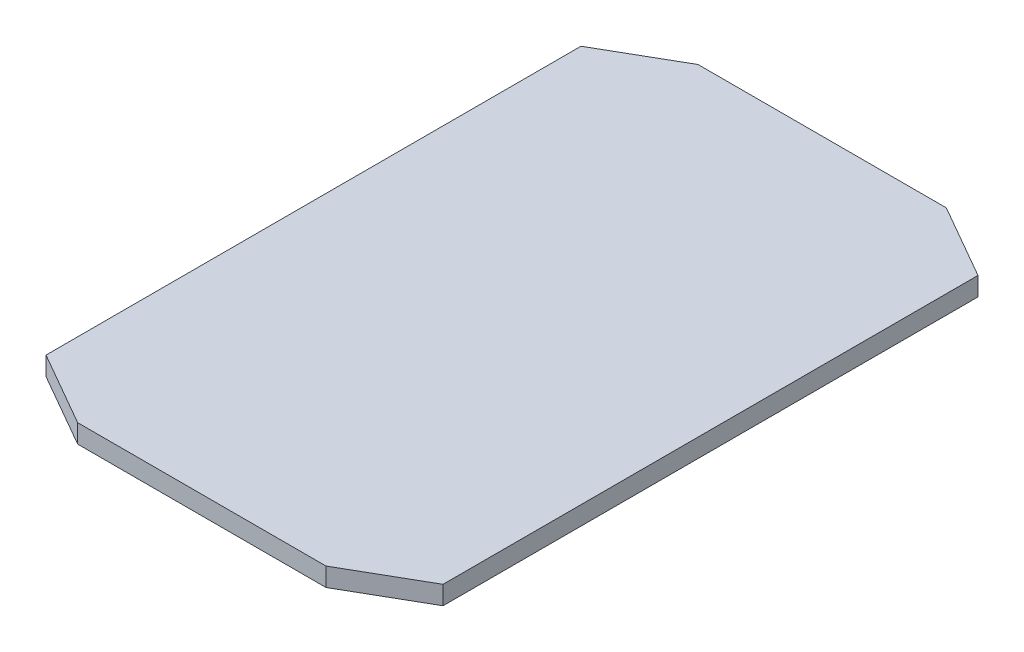
ISO-10303-21;
HEADER;
FILE_DESCRIPTION(('STEP AP214'),'2;1');
FILE_NAME('part.step','',(''),(''),'','','');
FILE_SCHEMA(('AUTOMOTIVE_DESIGN { 1 0 10303 214 1 1 1 1 }'));
ENDSEC;
DATA;
#1=APPLICATION_CONTEXT('core data for automotive mechanical design processes');
#2=APPLICATION_PROTOCOL_DEFINITION('international standard','automotive_design',2000,#1);
#3=PRODUCT_CONTEXT('',#1,'mechanical');
#4=PRODUCT('Part','Part','',(#3));
#5=PRODUCT_RELATED_PRODUCT_CATEGORY('part','',(#4));
#6=PRODUCT_DEFINITION_FORMATION('','',#4);
#7=PRODUCT_DEFINITION_CONTEXT('part definition',#1,'design');
#8=PRODUCT_DEFINITION('design','',#6,#7);
#9=PRODUCT_DEFINITION_SHAPE('','',#8);
#10=(LENGTH_UNIT() NAMED_UNIT(*) SI_UNIT(.MILLI.,.METRE.));
#11=(NAMED_UNIT(*) PLANE_ANGLE_UNIT() SI_UNIT($,.RADIAN.));
#12=(NAMED_UNIT(*) SI_UNIT($,.STERADIAN.) SOLID_ANGLE_UNIT());
#13=UNCERTAINTY_MEASURE_WITH_UNIT(LENGTH_MEASURE(1.E-05),#10,'distance_accuracy_value','');
#14=(GEOMETRIC_REPRESENTATION_CONTEXT(3) GLOBAL_UNCERTAINTY_ASSIGNED_CONTEXT((#13)) GLOBAL_UNIT_ASSIGNED_CONTEXT((#10,
#11,#12)) REPRESENTATION_CONTEXT('',''));
#15=CARTESIAN_POINT('',(0.,0.,0.));
#16=DIRECTION('',(0.,0.,1.));
#17=DIRECTION('',(1.,0.,0.));
#18=AXIS2_PLACEMENT_3D('',#15,#16,#17);
#19=CARTESIAN_POINT('',(-32.,3.,43.1177077057705));
#20=DIRECTION('',(1.,0.,0.));
#21=DIRECTION('',(0.,0.,-1.));
#22=AXIS2_PLACEMENT_3D('',#19,#20,#21);
#23=PLANE('',#22);
#24=DIRECTION('',(0.,0.,1.));
#25=VECTOR('',#24,1.);
#26=CARTESIAN_POINT('',(-32.,0.,43.1177077057705));
#27=LINE('',#26,#25);
#28=CARTESIAN_POINT('',(-32.,0.,-43.1177077057705));
#29=VERTEX_POINT('',#28);
#30=CARTESIAN_POINT('',(-32.,0.,43.1177077057705));
#31=VERTEX_POINT('',#30);
#32=EDGE_CURVE('E132',#29,#31,#27,.T.);
#33=ORIENTED_EDGE('',*,*,#32,.T.);
#34=DIRECTION('',(0.,-1.,0.));
#35=VECTOR('',#34,1.);
#36=CARTESIAN_POINT('',(-32.,3.,43.1177077057705));
#37=LINE('',#36,#35);
#38=CARTESIAN_POINT('',(-32.,3.,43.1177077057705));
#39=VERTEX_POINT('',#38);
#40=EDGE_CURVE('E11',#39,#31,#37,.T.);
#41=ORIENTED_EDGE('',*,*,#40,.F.);
#42=DIRECTION('',(0.,0.,1.));
#43=VECTOR('',#42,1.);
#44=CARTESIAN_POINT('',(-32.,3.,43.1177077057705));
#45=LINE('',#44,#43);
#46=CARTESIAN_POINT('',(-32.,3.,-43.1177077057705));
#47=VERTEX_POINT('',#46);
#48=EDGE_CURVE('E146',#47,#39,#45,.T.);
#49=ORIENTED_EDGE('',*,*,#48,.F.);
#50=DIRECTION('',(0.,-1.,0.));
#51=VECTOR('',#50,1.);
#52=CARTESIAN_POINT('',(-32.,3.,-43.1177077057705));
#53=LINE('',#52,#51);
#54=EDGE_CURVE('E128',#47,#29,#53,.T.);
#55=ORIENTED_EDGE('',*,*,#54,.T.);
#56=EDGE_LOOP('',(#33,#41,#49,#55));
#57=FACE_BOUND('',#56,.T.);
#58=ADVANCED_FACE('F36',(#57),#23,.F.);
#59=CARTESIAN_POINT('',(-32.,3.,43.1177077057705));
#60=DIRECTION('',(0.49788015877383,0.,-0.867245840289445));
#61=DIRECTION('',(-0.867245840289445,0.,-0.49788015877383));
#62=AXIS2_PLACEMENT_3D('',#59,#60,#61);
#63=PLANE('',#62);
#64=DIRECTION('',(0.867245840289445,0.,0.49788015877383));
#65=VECTOR('',#64,1.);
#66=CARTESIAN_POINT('',(-32.,0.,43.1177077057705));
#67=LINE('',#66,#65);
#68=CARTESIAN_POINT('',(-20.0118955161297,0.,50.));
#69=VERTEX_POINT('',#68);
#70=EDGE_CURVE('E135',#31,#69,#67,.T.);
#71=ORIENTED_EDGE('',*,*,#70,.T.);
#72=DIRECTION('',(0.,-1.,0.));
#73=VECTOR('',#72,1.);
#74=CARTESIAN_POINT('',(-20.0118955161297,3.,50.));
#75=LINE('',#74,#73);
#76=CARTESIAN_POINT('',(-20.0118955161297,3.,50.));
#77=VERTEX_POINT('',#76);
#78=EDGE_CURVE('E44',#77,#69,#75,.T.);
#79=ORIENTED_EDGE('',*,*,#78,.F.);
#80=DIRECTION('',(0.867245840289445,0.,0.49788015877383));
#81=VECTOR('',#80,1.);
#82=CARTESIAN_POINT('',(-32.,3.,43.1177077057705));
#83=LINE('',#82,#81);
#84=EDGE_CURVE('E95',#39,#77,#83,.T.);
#85=ORIENTED_EDGE('',*,*,#84,.F.);
#86=ORIENTED_EDGE('',*,*,#40,.T.);
#87=EDGE_LOOP('',(#71,#79,#85,#86));
#88=FACE_BOUND('',#87,.T.);
#89=ADVANCED_FACE('F181',(#88),#63,.F.);
#90=CARTESIAN_POINT('',(-20.0118955161297,3.,50.));
#91=DIRECTION('',(0.,0.,-1.));
#92=DIRECTION('',(-1.,0.,0.));
#93=AXIS2_PLACEMENT_3D('',#90,#91,#92);
#94=PLANE('',#93);
#95=DIRECTION('',(1.,0.,0.));
#96=VECTOR('',#95,1.);
#97=CARTESIAN_POINT('',(-20.0118955161297,0.,50.));
#98=LINE('',#97,#96);
#99=CARTESIAN_POINT('',(20.0118955161297,0.,50.));
#100=VERTEX_POINT('',#99);
#101=EDGE_CURVE('E137',#69,#100,#98,.T.);
#102=ORIENTED_EDGE('',*,*,#101,.T.);
#103=DIRECTION('',(0.,-1.,0.));
#104=VECTOR('',#103,1.);
#105=CARTESIAN_POINT('',(20.0118955161297,3.,50.));
#106=LINE('',#105,#104);
#107=CARTESIAN_POINT('',(20.0118955161297,3.,50.));
#108=VERTEX_POINT('',#107);
#109=EDGE_CURVE('E153',#108,#100,#106,.T.);
#110=ORIENTED_EDGE('',*,*,#109,.F.);
#111=DIRECTION('',(1.,0.,0.));
#112=VECTOR('',#111,1.);
#113=CARTESIAN_POINT('',(-20.0118955161297,3.,50.));
#114=LINE('',#113,#112);
#115=EDGE_CURVE('E161',#77,#108,#114,.T.);
#116=ORIENTED_EDGE('',*,*,#115,.F.);
#117=ORIENTED_EDGE('',*,*,#78,.T.);
#118=EDGE_LOOP('',(#102,#110,#116,#117));
#119=FACE_BOUND('',#118,.T.);
#120=ADVANCED_FACE('F159',(#119),#94,.F.);
#121=CARTESIAN_POINT('',(32.,3.,43.1177077057705));
#122=DIRECTION('',(-0.49788015877383,0.,-0.867245840289445));
#123=DIRECTION('',(-0.867245840289445,0.,0.49788015877383));
#124=AXIS2_PLACEMENT_3D('',#121,#122,#123);
#125=PLANE('',#124);
#126=DIRECTION('',(0.867245840289445,0.,-0.49788015877383));
#127=VECTOR('',#126,1.);
#128=CARTESIAN_POINT('',(32.,0.,43.1177077057705));
#129=LINE('',#128,#127);
#130=CARTESIAN_POINT('',(32.,0.,43.1177077057705));
#131=VERTEX_POINT('',#130);
#132=EDGE_CURVE('E139',#100,#131,#129,.T.);
#133=ORIENTED_EDGE('',*,*,#132,.T.);
#134=DIRECTION('',(0.,-1.,0.));
#135=VECTOR('',#134,1.);
#136=CARTESIAN_POINT('',(32.,3.,43.1177077057705));
#137=LINE('',#136,#135);
#138=CARTESIAN_POINT('',(32.,3.,43.1177077057705));
#139=VERTEX_POINT('',#138);
#140=EDGE_CURVE('E150',#139,#131,#137,.T.);
#141=ORIENTED_EDGE('',*,*,#140,.F.);
#142=DIRECTION('',(0.867245840289445,0.,-0.49788015877383));
#143=VECTOR('',#142,1.);
#144=CARTESIAN_POINT('',(32.,3.,43.1177077057705));
#145=LINE('',#144,#143);
#146=EDGE_CURVE('E173',#108,#139,#145,.T.);
#147=ORIENTED_EDGE('',*,*,#146,.F.);
#148=ORIENTED_EDGE('',*,*,#109,.T.);
#149=EDGE_LOOP('',(#133,#141,#147,#148));
#150=FACE_BOUND('',#149,.T.);
#151=ADVANCED_FACE('F169',(#150),#125,.F.);
#152=CARTESIAN_POINT('',(32.,3.,43.1177077057705));
#153=DIRECTION('',(-1.,0.,0.));
#154=DIRECTION('',(0.,0.,1.));
#155=AXIS2_PLACEMENT_3D('',#152,#153,#154);
#156=PLANE('',#155);
#157=DIRECTION('',(0.,0.,-1.));
#158=VECTOR('',#157,1.);
#159=CARTESIAN_POINT('',(32.,0.,43.1177077057705));
#160=LINE('',#159,#158);
#161=CARTESIAN_POINT('',(32.,0.,-43.1177077057705));
#162=VERTEX_POINT('',#161);
#163=EDGE_CURVE('E141',#131,#162,#160,.T.);
#164=ORIENTED_EDGE('',*,*,#163,.T.);
#165=DIRECTION('',(0.,-1.,0.));
#166=VECTOR('',#165,1.);
#167=CARTESIAN_POINT('',(32.,3.,-43.1177077057705));
#168=LINE('',#167,#166);
#169=CARTESIAN_POINT('',(32.,3.,-43.1177077057705));
#170=VERTEX_POINT('',#169);
#171=EDGE_CURVE('E123',#170,#162,#168,.T.);
#172=ORIENTED_EDGE('',*,*,#171,.F.);
#173=DIRECTION('',(0.,0.,-1.));
#174=VECTOR('',#173,1.);
#175=CARTESIAN_POINT('',(32.,3.,43.1177077057705));
#176=LINE('',#175,#174);
#177=EDGE_CURVE('E114',#139,#170,#176,.T.);
#178=ORIENTED_EDGE('',*,*,#177,.F.);
#179=ORIENTED_EDGE('',*,*,#140,.T.);
#180=EDGE_LOOP('',(#164,#172,#178,#179));
#181=FACE_BOUND('',#180,.T.);
#182=ADVANCED_FACE('F172',(#181),#156,.F.);
#183=CARTESIAN_POINT('',(32.,3.,-43.1177077057705));
#184=DIRECTION('',(-0.49788015877383,0.,0.867245840289445));
#185=DIRECTION('',(0.867245840289445,0.,0.49788015877383));
#186=AXIS2_PLACEMENT_3D('',#183,#184,#185);
#187=PLANE('',#186);
#188=DIRECTION('',(-0.867245840289445,0.,-0.49788015877383));
#189=VECTOR('',#188,1.);
#190=CARTESIAN_POINT('',(32.,0.,-43.1177077057705));
#191=LINE('',#190,#189);
#192=CARTESIAN_POINT('',(20.0118955161297,0.,-50.));
#193=VERTEX_POINT('',#192);
#194=EDGE_CURVE('E122',#162,#193,#191,.T.);
#195=ORIENTED_EDGE('',*,*,#194,.T.);
#196=DIRECTION('',(0.,-1.,0.));
#197=VECTOR('',#196,1.);
#198=CARTESIAN_POINT('',(20.0118955161297,3.,-50.));
#199=LINE('',#198,#197);
#200=CARTESIAN_POINT('',(20.0118955161297,3.,-50.));
#201=VERTEX_POINT('',#200);
#202=EDGE_CURVE('E119',#201,#193,#199,.T.);
#203=ORIENTED_EDGE('',*,*,#202,.F.);
#204=DIRECTION('',(-0.867245840289445,0.,-0.49788015877383));
#205=VECTOR('',#204,1.);
#206=CARTESIAN_POINT('',(32.,3.,-43.1177077057705));
#207=LINE('',#206,#205);
#208=EDGE_CURVE('E108',#170,#201,#207,.T.);
#209=ORIENTED_EDGE('',*,*,#208,.F.);
#210=ORIENTED_EDGE('',*,*,#171,.T.);
#211=EDGE_LOOP('',(#195,#203,#209,#210));
#212=FACE_BOUND('',#211,.T.);
#213=ADVANCED_FACE('F120',(#212),#187,.F.);
#214=CARTESIAN_POINT('',(-20.0118955161297,3.,-50.));
#215=DIRECTION('',(0.,0.,1.));
#216=DIRECTION('',(1.,0.,0.));
#217=AXIS2_PLACEMENT_3D('',#214,#215,#216);
#218=PLANE('',#217);
#219=DIRECTION('',(-1.,0.,0.));
#220=VECTOR('',#219,1.);
#221=CARTESIAN_POINT('',(-20.0118955161297,0.,-50.));
#222=LINE('',#221,#220);
#223=CARTESIAN_POINT('',(-20.0118955161297,0.,-50.));
#224=VERTEX_POINT('',#223);
#225=EDGE_CURVE('E81',#193,#224,#222,.T.);
#226=ORIENTED_EDGE('',*,*,#225,.T.);
#227=DIRECTION('',(0.,-1.,0.));
#228=VECTOR('',#227,1.);
#229=CARTESIAN_POINT('',(-20.0118955161297,3.,-50.));
#230=LINE('',#229,#228);
#231=CARTESIAN_POINT('',(-20.0118955161297,3.,-50.));
#232=VERTEX_POINT('',#231);
#233=EDGE_CURVE('E124',#232,#224,#230,.T.);
#234=ORIENTED_EDGE('',*,*,#233,.F.);
#235=DIRECTION('',(-1.,0.,0.));
#236=VECTOR('',#235,1.);
#237=CARTESIAN_POINT('',(-20.0118955161297,3.,-50.));
#238=LINE('',#237,#236);
#239=EDGE_CURVE('E112',#201,#232,#238,.T.);
#240=ORIENTED_EDGE('',*,*,#239,.F.);
#241=ORIENTED_EDGE('',*,*,#202,.T.);
#242=EDGE_LOOP('',(#226,#234,#240,#241));
#243=FACE_BOUND('',#242,.T.);
#244=ADVANCED_FACE('F126',(#243),#218,.F.);
#245=CARTESIAN_POINT('',(-32.,3.,-43.1177077057705));
#246=DIRECTION('',(0.49788015877383,0.,0.867245840289445));
#247=DIRECTION('',(0.867245840289445,0.,-0.49788015877383));
#248=AXIS2_PLACEMENT_3D('',#245,#246,#247);
#249=PLANE('',#248);
#250=DIRECTION('',(-0.867245840289445,0.,0.49788015877383));
#251=VECTOR('',#250,1.);
#252=CARTESIAN_POINT('',(-32.,0.,-43.1177077057705));
#253=LINE('',#252,#251);
#254=EDGE_CURVE('E87',#224,#29,#253,.T.);
#255=ORIENTED_EDGE('',*,*,#254,.T.);
#256=ORIENTED_EDGE('',*,*,#54,.F.);
#257=DIRECTION('',(-0.867245840289445,0.,0.49788015877383));
#258=VECTOR('',#257,1.);
#259=CARTESIAN_POINT('',(-32.,3.,-43.1177077057705));
#260=LINE('',#259,#258);
#261=EDGE_CURVE('E52',#232,#47,#260,.T.);
#262=ORIENTED_EDGE('',*,*,#261,.F.);
#263=ORIENTED_EDGE('',*,*,#233,.T.);
#264=EDGE_LOOP('',(#255,#256,#262,#263));
#265=FACE_BOUND('',#264,.T.);
#266=ADVANCED_FACE('F197',(#265),#249,.F.);
#267=CARTESIAN_POINT('',(0.,3.,0.));
#268=DIRECTION('',(0.,-1.,0.));
#269=DIRECTION('',(0.,0.,-1.));
#270=AXIS2_PLACEMENT_3D('',#267,#268,#269);
#271=PLANE('',#270);
#272=ORIENTED_EDGE('',*,*,#48,.T.);
#273=ORIENTED_EDGE('',*,*,#84,.T.);
#274=ORIENTED_EDGE('',*,*,#115,.T.);
#275=ORIENTED_EDGE('',*,*,#146,.T.);
#276=ORIENTED_EDGE('',*,*,#177,.T.);
#277=ORIENTED_EDGE('',*,*,#208,.T.);
#278=ORIENTED_EDGE('',*,*,#239,.T.);
#279=ORIENTED_EDGE('',*,*,#261,.T.);
#280=EDGE_LOOP('',(#272,#273,#274,#275,#276,#277,#278,#279));
#281=FACE_BOUND('',#280,.T.);
#282=ADVANCED_FACE('F110',(#281),#271,.F.);
#283=CARTESIAN_POINT('',(0.,0.,0.));
#284=DIRECTION('',(0.,-1.,0.));
#285=DIRECTION('',(0.,0.,-1.));
#286=AXIS2_PLACEMENT_3D('',#283,#284,#285);
#287=PLANE('',#286);
#288=ORIENTED_EDGE('',*,*,#32,.F.);
#289=ORIENTED_EDGE('',*,*,#254,.F.);
#290=ORIENTED_EDGE('',*,*,#225,.F.);
#291=ORIENTED_EDGE('',*,*,#194,.F.);
#292=ORIENTED_EDGE('',*,*,#163,.F.);
#293=ORIENTED_EDGE('',*,*,#132,.F.);
#294=ORIENTED_EDGE('',*,*,#101,.F.);
#295=ORIENTED_EDGE('',*,*,#70,.F.);
#296=EDGE_LOOP('',(#288,#289,#290,#291,#292,#293,#294,#295));
#297=FACE_BOUND('',#296,.T.);
#298=ADVANCED_FACE('F165',(#297),#287,.T.);
#299=CLOSED_SHELL('',(#58,#89,#120,#151,#182,#213,#244,#266,#282,#298));
#300=MANIFOLD_SOLID_BREP('B2',#299);
#301=ADVANCED_BREP_SHAPE_REPRESENTATION('',(#18,#300),#14);
#302=SHAPE_DEFINITION_REPRESENTATION(#9,#301);
ENDSEC;
END-ISO-10303-21;
